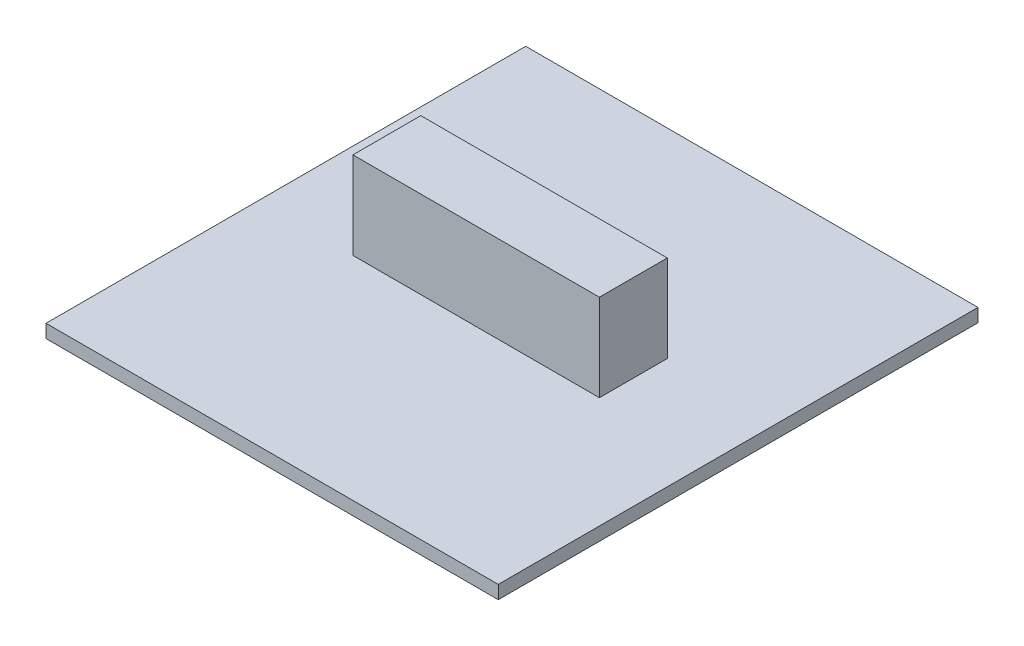
ISO-10303-21;
HEADER;
FILE_DESCRIPTION(('STEP AP214'),'2;1');
FILE_NAME('part.step','',(''),(''),'','','');
FILE_SCHEMA(('AUTOMOTIVE_DESIGN { 1 0 10303 214 1 1 1 1 }'));
ENDSEC;
DATA;
#1=APPLICATION_CONTEXT('core data for automotive mechanical design processes');
#2=APPLICATION_PROTOCOL_DEFINITION('international standard','automotive_design',2000,#1);
#3=PRODUCT_CONTEXT('',#1,'mechanical');
#4=PRODUCT('Part','Part','',(#3));
#5=PRODUCT_RELATED_PRODUCT_CATEGORY('part','',(#4));
#6=PRODUCT_DEFINITION_FORMATION('','',#4);
#7=PRODUCT_DEFINITION_CONTEXT('part definition',#1,'design');
#8=PRODUCT_DEFINITION('design','',#6,#7);
#9=PRODUCT_DEFINITION_SHAPE('','',#8);
#10=(LENGTH_UNIT() NAMED_UNIT(*) SI_UNIT(.MILLI.,.METRE.));
#11=(NAMED_UNIT(*) PLANE_ANGLE_UNIT() SI_UNIT($,.RADIAN.));
#12=(NAMED_UNIT(*) SI_UNIT($,.STERADIAN.) SOLID_ANGLE_UNIT());
#13=UNCERTAINTY_MEASURE_WITH_UNIT(LENGTH_MEASURE(1.E-05),#10,'distance_accuracy_value','');
#14=(GEOMETRIC_REPRESENTATION_CONTEXT(3) GLOBAL_UNCERTAINTY_ASSIGNED_CONTEXT((#13)) GLOBAL_UNIT_ASSIGNED_CONTEXT((#10,
#11,#12)) REPRESENTATION_CONTEXT('',''));
#15=CARTESIAN_POINT('',(0.,0.,0.));
#16=DIRECTION('',(0.,0.,1.));
#17=DIRECTION('',(1.,0.,0.));
#18=AXIS2_PLACEMENT_3D('',#15,#16,#17);
#19=CARTESIAN_POINT('',(0.,2.286,0.));
#20=DIRECTION('',(0.,1.,0.));
#21=DIRECTION('',(0.,0.,1.));
#22=AXIS2_PLACEMENT_3D('',#19,#20,#21);
#23=PLANE('',#22);
#24=DIRECTION('',(0.,0.,1.));
#25=VECTOR('',#24,1.);
#26=CARTESIAN_POINT('',(0.,2.286,0.));
#27=LINE('',#26,#25);
#28=CARTESIAN_POINT('',(0.,2.286,0.));
#29=VERTEX_POINT('',#28);
#30=CARTESIAN_POINT('',(0.,2.286,82.55));
#31=VERTEX_POINT('',#30);
#32=EDGE_CURVE('E139',#29,#31,#27,.T.);
#33=ORIENTED_EDGE('',*,*,#32,.T.);
#34=DIRECTION('',(1.,0.,0.));
#35=VECTOR('',#34,1.);
#36=CARTESIAN_POINT('',(0.,2.286,82.55));
#37=LINE('',#36,#35);
#38=CARTESIAN_POINT('',(77.8256,2.286,82.55));
#39=VERTEX_POINT('',#38);
#40=EDGE_CURVE('E84',#31,#39,#37,.T.);
#41=ORIENTED_EDGE('',*,*,#40,.T.);
#42=DIRECTION('',(0.,0.,-1.));
#43=VECTOR('',#42,1.);
#44=CARTESIAN_POINT('',(77.8256,2.286,0.));
#45=LINE('',#44,#43);
#46=CARTESIAN_POINT('',(77.8256,2.286,0.));
#47=VERTEX_POINT('',#46);
#48=EDGE_CURVE('E142',#39,#47,#45,.T.);
#49=ORIENTED_EDGE('',*,*,#48,.T.);
#50=DIRECTION('',(-1.,0.,0.));
#51=VECTOR('',#50,1.);
#52=CARTESIAN_POINT('',(0.,2.286,0.));
#53=LINE('',#52,#51);
#54=EDGE_CURVE('E56',#47,#29,#53,.T.);
#55=ORIENTED_EDGE('',*,*,#54,.T.);
#56=EDGE_LOOP('',(#33,#41,#49,#55));
#57=FACE_BOUND('',#56,.T.);
#58=DIRECTION('',(1.,0.,0.));
#59=VECTOR('',#58,1.);
#60=CARTESIAN_POINT('',(16.2960583112408,2.286,46.0340063552849));
#61=LINE('',#60,#59);
#62=CARTESIAN_POINT('',(16.2960583112408,2.286,46.0340063552849));
#63=VERTEX_POINT('',#62);
#64=CARTESIAN_POINT('',(58.710311413904,2.286,46.0340063552849));
#65=VERTEX_POINT('',#64);
#66=EDGE_CURVE('E262',#63,#65,#61,.T.);
#67=ORIENTED_EDGE('',*,*,#66,.F.);
#68=DIRECTION('',(0.,0.,1.));
#69=VECTOR('',#68,1.);
#70=CARTESIAN_POINT('',(16.2960583112408,2.286,34.3514386780726));
#71=LINE('',#70,#69);
#72=CARTESIAN_POINT('',(16.2960583112408,2.286,34.3514386780726));
#73=VERTEX_POINT('',#72);
#74=EDGE_CURVE('E129',#73,#63,#71,.T.);
#75=ORIENTED_EDGE('',*,*,#74,.F.);
#76=DIRECTION('',(-1.,0.,0.));
#77=VECTOR('',#76,1.);
#78=CARTESIAN_POINT('',(16.2960583112408,2.286,34.3514386780726));
#79=LINE('',#78,#77);
#80=CARTESIAN_POINT('',(58.710311413904,2.286,34.3514386780726));
#81=VERTEX_POINT('',#80);
#82=EDGE_CURVE('E125',#81,#73,#79,.T.);
#83=ORIENTED_EDGE('',*,*,#82,.F.);
#84=DIRECTION('',(0.,0.,-1.));
#85=VECTOR('',#84,1.);
#86=CARTESIAN_POINT('',(58.710311413904,2.286,34.3514386780726));
#87=LINE('',#86,#85);
#88=EDGE_CURVE('E259',#65,#81,#87,.T.);
#89=ORIENTED_EDGE('',*,*,#88,.F.);
#90=EDGE_LOOP('',(#67,#75,#83,#89));
#91=FACE_BOUND('',#90,.T.);
#92=ADVANCED_FACE('F32',(#57,#91),#23,.T.);
#93=CARTESIAN_POINT('',(0.,2.286,0.));
#94=DIRECTION('',(1.,0.,0.));
#95=DIRECTION('',(0.,0.,-1.));
#96=AXIS2_PLACEMENT_3D('',#93,#94,#95);
#97=PLANE('',#96);
#98=DIRECTION('',(0.,0.,1.));
#99=VECTOR('',#98,1.);
#100=CARTESIAN_POINT('',(0.,0.,0.));
#101=LINE('',#100,#99);
#102=CARTESIAN_POINT('',(0.,0.,0.));
#103=VERTEX_POINT('',#102);
#104=CARTESIAN_POINT('',(0.,0.,82.55));
#105=VERTEX_POINT('',#104);
#106=EDGE_CURVE('E131',#103,#105,#101,.T.);
#107=ORIENTED_EDGE('',*,*,#106,.T.);
#108=DIRECTION('',(0.,-1.,0.));
#109=VECTOR('',#108,1.);
#110=CARTESIAN_POINT('',(0.,2.286,82.55));
#111=LINE('',#110,#109);
#112=EDGE_CURVE('E11',#31,#105,#111,.T.);
#113=ORIENTED_EDGE('',*,*,#112,.F.);
#114=ORIENTED_EDGE('',*,*,#32,.F.);
#115=DIRECTION('',(0.,-1.,0.));
#116=VECTOR('',#115,1.);
#117=CARTESIAN_POINT('',(0.,2.286,0.));
#118=LINE('',#117,#116);
#119=EDGE_CURVE('E144',#29,#103,#118,.T.);
#120=ORIENTED_EDGE('',*,*,#119,.T.);
#121=EDGE_LOOP('',(#107,#113,#114,#120));
#122=FACE_BOUND('',#121,.T.);
#123=ADVANCED_FACE('F34',(#122),#97,.F.);
#124=CARTESIAN_POINT('',(0.,2.286,82.55));
#125=DIRECTION('',(0.,0.,-1.));
#126=DIRECTION('',(-1.,0.,0.));
#127=AXIS2_PLACEMENT_3D('',#124,#125,#126);
#128=PLANE('',#127);
#129=DIRECTION('',(1.,0.,0.));
#130=VECTOR('',#129,1.);
#131=CARTESIAN_POINT('',(0.,0.,82.55));
#132=LINE('',#131,#130);
#133=CARTESIAN_POINT('',(77.8256,0.,82.55));
#134=VERTEX_POINT('',#133);
#135=EDGE_CURVE('E134',#105,#134,#132,.T.);
#136=ORIENTED_EDGE('',*,*,#135,.T.);
#137=DIRECTION('',(0.,-1.,0.));
#138=VECTOR('',#137,1.);
#139=CARTESIAN_POINT('',(77.8256,2.286,82.55));
#140=LINE('',#139,#138);
#141=EDGE_CURVE('E40',#39,#134,#140,.T.);
#142=ORIENTED_EDGE('',*,*,#141,.F.);
#143=ORIENTED_EDGE('',*,*,#40,.F.);
#144=ORIENTED_EDGE('',*,*,#112,.T.);
#145=EDGE_LOOP('',(#136,#142,#143,#144));
#146=FACE_BOUND('',#145,.T.);
#147=ADVANCED_FACE('F172',(#146),#128,.F.);
#148=CARTESIAN_POINT('',(77.8256,2.286,0.));
#149=DIRECTION('',(-1.,0.,0.));
#150=DIRECTION('',(0.,0.,1.));
#151=AXIS2_PLACEMENT_3D('',#148,#149,#150);
#152=PLANE('',#151);
#153=DIRECTION('',(0.,0.,-1.));
#154=VECTOR('',#153,1.);
#155=CARTESIAN_POINT('',(77.8256,0.,0.));
#156=LINE('',#155,#154);
#157=CARTESIAN_POINT('',(77.8256,0.,0.));
#158=VERTEX_POINT('',#157);
#159=EDGE_CURVE('E147',#134,#158,#156,.T.);
#160=ORIENTED_EDGE('',*,*,#159,.T.);
#161=DIRECTION('',(0.,-1.,0.));
#162=VECTOR('',#161,1.);
#163=CARTESIAN_POINT('',(77.8256,2.286,0.));
#164=LINE('',#163,#162);
#165=EDGE_CURVE('E151',#47,#158,#164,.T.);
#166=ORIENTED_EDGE('',*,*,#165,.F.);
#167=ORIENTED_EDGE('',*,*,#48,.F.);
#168=ORIENTED_EDGE('',*,*,#141,.T.);
#169=EDGE_LOOP('',(#160,#166,#167,#168));
#170=FACE_BOUND('',#169,.T.);
#171=ADVANCED_FACE('F156',(#170),#152,.F.);
#172=CARTESIAN_POINT('',(0.,2.286,0.));
#173=DIRECTION('',(0.,0.,1.));
#174=DIRECTION('',(1.,0.,0.));
#175=AXIS2_PLACEMENT_3D('',#172,#173,#174);
#176=PLANE('',#175);
#177=DIRECTION('',(-1.,0.,0.));
#178=VECTOR('',#177,1.);
#179=CARTESIAN_POINT('',(0.,0.,0.));
#180=LINE('',#179,#178);
#181=EDGE_CURVE('E77',#158,#103,#180,.T.);
#182=ORIENTED_EDGE('',*,*,#181,.T.);
#183=ORIENTED_EDGE('',*,*,#119,.F.);
#184=ORIENTED_EDGE('',*,*,#54,.F.);
#185=ORIENTED_EDGE('',*,*,#165,.T.);
#186=EDGE_LOOP('',(#182,#183,#184,#185));
#187=FACE_BOUND('',#186,.T.);
#188=ADVANCED_FACE('F164',(#187),#176,.F.);
#189=CARTESIAN_POINT('',(0.,0.,0.));
#190=DIRECTION('',(0.,1.,0.));
#191=DIRECTION('',(0.,0.,1.));
#192=AXIS2_PLACEMENT_3D('',#189,#190,#191);
#193=PLANE('',#192);
#194=ORIENTED_EDGE('',*,*,#106,.F.);
#195=ORIENTED_EDGE('',*,*,#181,.F.);
#196=ORIENTED_EDGE('',*,*,#159,.F.);
#197=ORIENTED_EDGE('',*,*,#135,.F.);
#198=EDGE_LOOP('',(#194,#195,#196,#197));
#199=FACE_BOUND('',#198,.T.);
#200=ADVANCED_FACE('F160',(#199),#193,.F.);
#201=CARTESIAN_POINT('',(16.2960583112408,17.272,34.3514386780726));
#202=DIRECTION('',(1.,0.,0.));
#203=DIRECTION('',(0.,0.,-1.));
#204=AXIS2_PLACEMENT_3D('',#201,#202,#203);
#205=PLANE('',#204);
#206=ORIENTED_EDGE('',*,*,#74,.T.);
#207=DIRECTION('',(0.,-1.,0.));
#208=VECTOR('',#207,1.);
#209=CARTESIAN_POINT('',(16.2960583112408,17.272,46.0340063552849));
#210=LINE('',#209,#208);
#211=CARTESIAN_POINT('',(16.2960583112408,17.272,46.0340063552849));
#212=VERTEX_POINT('',#211);
#213=EDGE_CURVE('E110',#212,#63,#210,.T.);
#214=ORIENTED_EDGE('',*,*,#213,.F.);
#215=DIRECTION('',(0.,0.,1.));
#216=VECTOR('',#215,1.);
#217=CARTESIAN_POINT('',(16.2960583112408,17.272,34.3514386780726));
#218=LINE('',#217,#216);
#219=CARTESIAN_POINT('',(16.2960583112408,17.272,34.3514386780726));
#220=VERTEX_POINT('',#219);
#221=EDGE_CURVE('E117',#220,#212,#218,.T.);
#222=ORIENTED_EDGE('',*,*,#221,.F.);
#223=DIRECTION('',(0.,-1.,0.));
#224=VECTOR('',#223,1.);
#225=CARTESIAN_POINT('',(16.2960583112408,17.272,34.3514386780726));
#226=LINE('',#225,#224);
#227=EDGE_CURVE('E257',#220,#73,#226,.T.);
#228=ORIENTED_EDGE('',*,*,#227,.T.);
#229=EDGE_LOOP('',(#206,#214,#222,#228));
#230=FACE_BOUND('',#229,.T.);
#231=ADVANCED_FACE('F127',(#230),#205,.F.);
#232=CARTESIAN_POINT('',(16.2960583112408,17.272,46.0340063552849));
#233=DIRECTION('',(0.,0.,-1.));
#234=DIRECTION('',(-1.,0.,0.));
#235=AXIS2_PLACEMENT_3D('',#232,#233,#234);
#236=PLANE('',#235);
#237=ORIENTED_EDGE('',*,*,#66,.T.);
#238=DIRECTION('',(0.,-1.,0.));
#239=VECTOR('',#238,1.);
#240=CARTESIAN_POINT('',(58.710311413904,17.272,46.0340063552849));
#241=LINE('',#240,#239);
#242=CARTESIAN_POINT('',(58.710311413904,17.272,46.0340063552849));
#243=VERTEX_POINT('',#242);
#244=EDGE_CURVE('E113',#243,#65,#241,.T.);
#245=ORIENTED_EDGE('',*,*,#244,.F.);
#246=DIRECTION('',(1.,0.,0.));
#247=VECTOR('',#246,1.);
#248=CARTESIAN_POINT('',(16.2960583112408,17.272,46.0340063552849));
#249=LINE('',#248,#247);
#250=EDGE_CURVE('E106',#212,#243,#249,.T.);
#251=ORIENTED_EDGE('',*,*,#250,.F.);
#252=ORIENTED_EDGE('',*,*,#213,.T.);
#253=EDGE_LOOP('',(#237,#245,#251,#252));
#254=FACE_BOUND('',#253,.T.);
#255=ADVANCED_FACE('F108',(#254),#236,.F.);
#256=CARTESIAN_POINT('',(58.710311413904,17.272,34.3514386780726));
#257=DIRECTION('',(-1.,0.,0.));
#258=DIRECTION('',(0.,0.,1.));
#259=AXIS2_PLACEMENT_3D('',#256,#257,#258);
#260=PLANE('',#259);
#261=ORIENTED_EDGE('',*,*,#88,.T.);
#262=DIRECTION('',(0.,-1.,0.));
#263=VECTOR('',#262,1.);
#264=CARTESIAN_POINT('',(58.710311413904,17.272,34.3514386780726));
#265=LINE('',#264,#263);
#266=CARTESIAN_POINT('',(58.710311413904,17.272,34.3514386780726));
#267=VERTEX_POINT('',#266);
#268=EDGE_CURVE('E47',#267,#81,#265,.T.);
#269=ORIENTED_EDGE('',*,*,#268,.F.);
#270=DIRECTION('',(0.,0.,-1.));
#271=VECTOR('',#270,1.);
#272=CARTESIAN_POINT('',(58.710311413904,17.272,34.3514386780726));
#273=LINE('',#272,#271);
#274=EDGE_CURVE('E116',#243,#267,#273,.T.);
#275=ORIENTED_EDGE('',*,*,#274,.F.);
#276=ORIENTED_EDGE('',*,*,#244,.T.);
#277=EDGE_LOOP('',(#261,#269,#275,#276));
#278=FACE_BOUND('',#277,.T.);
#279=ADVANCED_FACE('F185',(#278),#260,.F.);
#280=CARTESIAN_POINT('',(16.2960583112408,17.272,34.3514386780726));
#281=DIRECTION('',(0.,0.,1.));
#282=DIRECTION('',(1.,0.,0.));
#283=AXIS2_PLACEMENT_3D('',#280,#281,#282);
#284=PLANE('',#283);
#285=ORIENTED_EDGE('',*,*,#82,.T.);
#286=ORIENTED_EDGE('',*,*,#227,.F.);
#287=DIRECTION('',(-1.,0.,0.));
#288=VECTOR('',#287,1.);
#289=CARTESIAN_POINT('',(16.2960583112408,17.272,34.3514386780726));
#290=LINE('',#289,#288);
#291=EDGE_CURVE('E121',#267,#220,#290,.T.);
#292=ORIENTED_EDGE('',*,*,#291,.F.);
#293=ORIENTED_EDGE('',*,*,#268,.T.);
#294=EDGE_LOOP('',(#285,#286,#292,#293));
#295=FACE_BOUND('',#294,.T.);
#296=ADVANCED_FACE('F188',(#295),#284,.F.);
#297=CARTESIAN_POINT('',(0.,17.272,0.));
#298=DIRECTION('',(0.,1.,0.));
#299=DIRECTION('',(0.,0.,1.));
#300=AXIS2_PLACEMENT_3D('',#297,#298,#299);
#301=PLANE('',#300);
#302=ORIENTED_EDGE('',*,*,#221,.T.);
#303=ORIENTED_EDGE('',*,*,#250,.T.);
#304=ORIENTED_EDGE('',*,*,#274,.T.);
#305=ORIENTED_EDGE('',*,*,#291,.T.);
#306=EDGE_LOOP('',(#302,#303,#304,#305));
#307=FACE_BOUND('',#306,.T.);
#308=ADVANCED_FACE('F120',(#307),#301,.T.);
#309=CLOSED_SHELL('',(#92,#123,#147,#171,#188,#200,#231,#255,#279,#296,#308));
#310=MANIFOLD_SOLID_BREP('B2',#309);
#311=ADVANCED_BREP_SHAPE_REPRESENTATION('',(#18,#310),#14);
#312=SHAPE_DEFINITION_REPRESENTATION(#9,#311);
ENDSEC;
END-ISO-10303-21;
